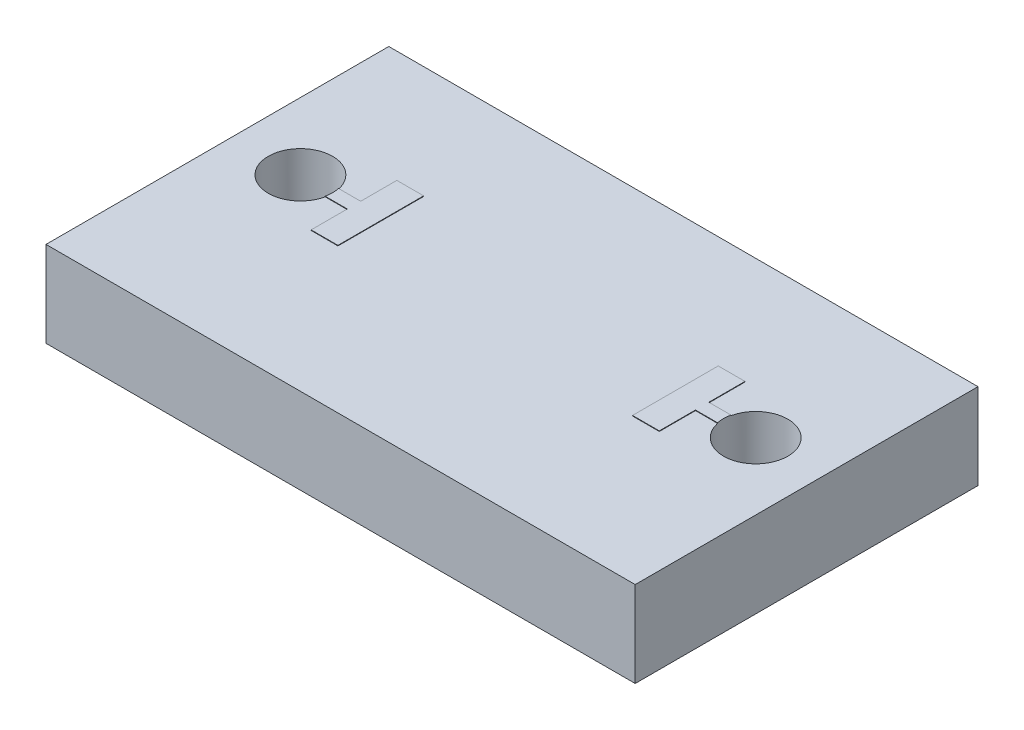
ISO-10303-21;
HEADER;
FILE_DESCRIPTION(('STEP AP214'),'2;1');
FILE_NAME('part.step','',(''),(''),'','','');
FILE_SCHEMA(('AUTOMOTIVE_DESIGN { 1 0 10303 214 1 1 1 1 }'));
ENDSEC;
DATA;
#1=APPLICATION_CONTEXT('core data for automotive mechanical design processes');
#2=APPLICATION_PROTOCOL_DEFINITION('international standard','automotive_design',2000,#1);
#3=PRODUCT_CONTEXT('',#1,'mechanical');
#4=PRODUCT('Part','Part','',(#3));
#5=PRODUCT_RELATED_PRODUCT_CATEGORY('part','',(#4));
#6=PRODUCT_DEFINITION_FORMATION('','',#4);
#7=PRODUCT_DEFINITION_CONTEXT('part definition',#1,'design');
#8=PRODUCT_DEFINITION('design','',#6,#7);
#9=PRODUCT_DEFINITION_SHAPE('','',#8);
#10=(LENGTH_UNIT() NAMED_UNIT(*) SI_UNIT(.MILLI.,.METRE.));
#11=(NAMED_UNIT(*) PLANE_ANGLE_UNIT() SI_UNIT($,.RADIAN.));
#12=(NAMED_UNIT(*) SI_UNIT($,.STERADIAN.) SOLID_ANGLE_UNIT());
#13=UNCERTAINTY_MEASURE_WITH_UNIT(LENGTH_MEASURE(1.E-05),#10,'distance_accuracy_value','');
#14=(GEOMETRIC_REPRESENTATION_CONTEXT(3) GLOBAL_UNCERTAINTY_ASSIGNED_CONTEXT((#13)) GLOBAL_UNIT_ASSIGNED_CONTEXT((#10,
#11,#12)) REPRESENTATION_CONTEXT('',''));
#15=CARTESIAN_POINT('',(0.,0.,0.));
#16=DIRECTION('',(0.,0.,1.));
#17=DIRECTION('',(1.,0.,0.));
#18=AXIS2_PLACEMENT_3D('',#15,#16,#17);
#19=CARTESIAN_POINT('',(0.,1.60000000000001,0.));
#20=DIRECTION('',(0.,-1.,0.));
#21=DIRECTION('',(0.,0.,-1.));
#22=AXIS2_PLACEMENT_3D('',#19,#20,#21);
#23=PLANE('',#22);
#24=DIRECTION('',(-1.,0.,0.));
#25=VECTOR('',#24,1.);
#26=CARTESIAN_POINT('',(0.,1.60000000000001,-0.125000000000004));
#27=LINE('',#26,#25);
#28=CARTESIAN_POINT('',(3.66316527028472,1.60000000000001,-0.125));
#29=VERTEX_POINT('',#28);
#30=CARTESIAN_POINT('',(3.25,1.60000000000001,-0.125000000000004));
#31=VERTEX_POINT('',#30);
#32=EDGE_CURVE('E230',#29,#31,#27,.T.);
#33=ORIENTED_EDGE('',*,*,#32,.F.);
#34=CARTESIAN_POINT('',(4.25,1.60000000000001,0.));
#35=DIRECTION('',(0.,1.,0.));
#36=DIRECTION('',(0.,0.,1.));
#37=AXIS2_PLACEMENT_3D('',#34,#35,#36);
#38=CIRCLE('',#37,0.6);
#39=CARTESIAN_POINT('',(3.66316527028473,1.60000000000001,0.125000000000005));
#40=VERTEX_POINT('',#39);
#41=EDGE_CURVE('E322',#40,#29,#38,.T.);
#42=ORIENTED_EDGE('',*,*,#41,.F.);
#43=DIRECTION('',(-1.,0.,0.));
#44=VECTOR('',#43,1.);
#45=CARTESIAN_POINT('',(0.,1.60000000000001,0.125000000000002));
#46=LINE('',#45,#44);
#47=CARTESIAN_POINT('',(3.25000000000001,1.60000000000001,0.125000000000002));
#48=VERTEX_POINT('',#47);
#49=EDGE_CURVE('E235',#40,#48,#46,.T.);
#50=ORIENTED_EDGE('',*,*,#49,.T.);
#51=DIRECTION('',(0.,0.,-1.));
#52=VECTOR('',#51,1.);
#53=CARTESIAN_POINT('',(3.25,1.60000000000001,0.));
#54=LINE('',#53,#52);
#55=CARTESIAN_POINT('',(3.25,1.60000000000001,0.799999999999999));
#56=VERTEX_POINT('',#55);
#57=EDGE_CURVE('E302',#56,#48,#54,.T.);
#58=ORIENTED_EDGE('',*,*,#57,.F.);
#59=DIRECTION('',(-1.,0.,0.));
#60=VECTOR('',#59,1.);
#61=CARTESIAN_POINT('',(0.,1.60000000000001,0.799999999999995));
#62=LINE('',#61,#60);
#63=CARTESIAN_POINT('',(2.75,1.60000000000001,0.799999999999995));
#64=VERTEX_POINT('',#63);
#65=EDGE_CURVE('E299',#56,#64,#62,.T.);
#66=ORIENTED_EDGE('',*,*,#65,.T.);
#67=DIRECTION('',(0.,0.,-1.));
#68=VECTOR('',#67,1.);
#69=CARTESIAN_POINT('',(2.75,1.60000000000001,0.));
#70=LINE('',#69,#68);
#71=CARTESIAN_POINT('',(2.75,1.60000000000001,-0.800000000000001));
#72=VERTEX_POINT('',#71);
#73=EDGE_CURVE('E283',#64,#72,#70,.T.);
#74=ORIENTED_EDGE('',*,*,#73,.T.);
#75=DIRECTION('',(-1.,0.,0.));
#76=VECTOR('',#75,1.);
#77=CARTESIAN_POINT('',(0.,1.60000000000001,-0.799999999999999));
#78=LINE('',#77,#76);
#79=CARTESIAN_POINT('',(3.25,1.60000000000001,-0.8));
#80=VERTEX_POINT('',#79);
#81=EDGE_CURVE('E288',#80,#72,#78,.T.);
#82=ORIENTED_EDGE('',*,*,#81,.F.);
#83=EDGE_CURVE('E301',#31,#80,#54,.T.);
#84=ORIENTED_EDGE('',*,*,#83,.F.);
#85=EDGE_LOOP('',(#33,#42,#50,#58,#66,#74,#82,#84));
#86=FACE_BOUND('',#85,.T.);
#87=DIRECTION('',(0.,0.,-1.));
#88=VECTOR('',#87,1.);
#89=CARTESIAN_POINT('',(5.5,1.60000000000002,2.));
#90=LINE('',#89,#88);
#91=CARTESIAN_POINT('',(5.5,1.60000000000001,3.50000000000001));
#92=VERTEX_POINT('',#91);
#93=CARTESIAN_POINT('',(5.50000000000001,1.60000000000002,-2.9));
#94=VERTEX_POINT('',#93);
#95=EDGE_CURVE('E47',#92,#94,#90,.T.);
#96=ORIENTED_EDGE('',*,*,#95,.T.);
#97=DIRECTION('',(1.,0.,0.));
#98=VECTOR('',#97,1.);
#99=CARTESIAN_POINT('',(-5.5,1.60000000000001,-2.9));
#100=LINE('',#99,#98);
#101=CARTESIAN_POINT('',(-5.5,1.60000000000001,-2.9));
#102=VERTEX_POINT('',#101);
#103=EDGE_CURVE('E185',#102,#94,#100,.T.);
#104=ORIENTED_EDGE('',*,*,#103,.F.);
#105=DIRECTION('',(0.,0.,1.));
#106=VECTOR('',#105,1.);
#107=CARTESIAN_POINT('',(-5.5,1.60000000000001,2.));
#108=LINE('',#107,#106);
#109=CARTESIAN_POINT('',(-5.5,1.60000000000001,3.50000000000001));
#110=VERTEX_POINT('',#109);
#111=EDGE_CURVE('E11',#102,#110,#108,.T.);
#112=ORIENTED_EDGE('',*,*,#111,.T.);
#113=DIRECTION('',(-1.,0.,0.));
#114=VECTOR('',#113,1.);
#115=CARTESIAN_POINT('',(-5.5,1.60000000000001,3.50000000000001));
#116=LINE('',#115,#114);
#117=EDGE_CURVE('E206',#92,#110,#116,.T.);
#118=ORIENTED_EDGE('',*,*,#117,.F.);
#119=EDGE_LOOP('',(#96,#104,#112,#118));
#120=FACE_BOUND('',#119,.T.);
#121=DIRECTION('',(1.,0.,0.));
#122=VECTOR('',#121,1.);
#123=CARTESIAN_POINT('',(0.,1.60000000000001,0.125000000000002));
#124=LINE('',#123,#122);
#125=CARTESIAN_POINT('',(-3.66316527028473,1.60000000000001,0.125000000000007));
#126=VERTEX_POINT('',#125);
#127=CARTESIAN_POINT('',(-3.25,1.60000000000001,0.125000000000009));
#128=VERTEX_POINT('',#127);
#129=EDGE_CURVE('E55',#126,#128,#124,.T.);
#130=ORIENTED_EDGE('',*,*,#129,.F.);
#131=CARTESIAN_POINT('',(-4.25,1.60000000000001,0.));
#132=DIRECTION('',(0.,1.,0.));
#133=DIRECTION('',(0.,0.,1.));
#134=AXIS2_PLACEMENT_3D('',#131,#132,#133);
#135=CIRCLE('',#134,0.6);
#136=CARTESIAN_POINT('',(-3.66316527028472,1.60000000000001,-0.125000000000004));
#137=VERTEX_POINT('',#136);
#138=EDGE_CURVE('E59',#126,#137,#135,.F.);
#139=ORIENTED_EDGE('',*,*,#138,.T.);
#140=DIRECTION('',(1.,0.,0.));
#141=VECTOR('',#140,1.);
#142=CARTESIAN_POINT('',(0.,1.60000000000001,-0.125000000000004));
#143=LINE('',#142,#141);
#144=CARTESIAN_POINT('',(-3.25,1.60000000000001,-0.125000000000002));
#145=VERTEX_POINT('',#144);
#146=EDGE_CURVE('E212',#137,#145,#143,.T.);
#147=ORIENTED_EDGE('',*,*,#146,.T.);
#148=DIRECTION('',(0.,0.,-1.));
#149=VECTOR('',#148,1.);
#150=CARTESIAN_POINT('',(-3.25,1.60000000000001,0.));
#151=LINE('',#150,#149);
#152=CARTESIAN_POINT('',(-3.25,1.60000000000001,-0.800000000000004));
#153=VERTEX_POINT('',#152);
#154=EDGE_CURVE('E252',#145,#153,#151,.T.);
#155=ORIENTED_EDGE('',*,*,#154,.T.);
#156=DIRECTION('',(1.,0.,0.));
#157=VECTOR('',#156,1.);
#158=CARTESIAN_POINT('',(0.,1.60000000000001,-0.799999999999999));
#159=LINE('',#158,#157);
#160=CARTESIAN_POINT('',(-2.75,1.60000000000001,-0.799999999999999));
#161=VERTEX_POINT('',#160);
#162=EDGE_CURVE('E270',#153,#161,#159,.T.);
#163=ORIENTED_EDGE('',*,*,#162,.T.);
#164=DIRECTION('',(0.,0.,-1.));
#165=VECTOR('',#164,1.);
#166=CARTESIAN_POINT('',(-2.75,1.60000000000001,0.));
#167=LINE('',#166,#165);
#168=CARTESIAN_POINT('',(-2.75,1.60000000000001,0.799999999999995));
#169=VERTEX_POINT('',#168);
#170=EDGE_CURVE('E268',#169,#161,#167,.T.);
#171=ORIENTED_EDGE('',*,*,#170,.F.);
#172=DIRECTION('',(1.,0.,0.));
#173=VECTOR('',#172,1.);
#174=CARTESIAN_POINT('',(0.,1.60000000000001,0.799999999999995));
#175=LINE('',#174,#173);
#176=CARTESIAN_POINT('',(-3.25,1.60000000000001,0.799999999999995));
#177=VERTEX_POINT('',#176);
#178=EDGE_CURVE('E266',#177,#169,#175,.T.);
#179=ORIENTED_EDGE('',*,*,#178,.F.);
#180=EDGE_CURVE('E264',#177,#128,#151,.T.);
#181=ORIENTED_EDGE('',*,*,#180,.T.);
#182=EDGE_LOOP('',(#130,#139,#147,#155,#163,#171,#179,#181));
#183=FACE_BOUND('',#182,.T.);
#184=ADVANCED_FACE('F38',(#86,#120,#183),#23,.F.);
#185=CARTESIAN_POINT('',(-3.25,1.61000000000001,0.));
#186=DIRECTION('',(-1.,0.,0.));
#187=DIRECTION('',(0.,0.,1.));
#188=AXIS2_PLACEMENT_3D('',#185,#186,#187);
#189=PLANE('',#188);
#190=DIRECTION('',(0.,0.,-1.));
#191=VECTOR('',#190,1.);
#192=CARTESIAN_POINT('',(-3.25,1.61000000000001,0.));
#193=LINE('',#192,#191);
#194=CARTESIAN_POINT('',(-3.25,1.61000000000001,0.799999999999995));
#195=VERTEX_POINT('',#194);
#196=CARTESIAN_POINT('',(-3.25,1.61,0.125000000000005));
#197=VERTEX_POINT('',#196);
#198=EDGE_CURVE('E253',#195,#197,#193,.T.);
#199=ORIENTED_EDGE('',*,*,#198,.T.);
#200=DIRECTION('',(0.,-1.,0.));
#201=VECTOR('',#200,1.);
#202=CARTESIAN_POINT('',(-3.25,1.61,0.125000000000005));
#203=LINE('',#202,#201);
#204=EDGE_CURVE('E225',#197,#128,#203,.T.);
#205=ORIENTED_EDGE('',*,*,#204,.T.);
#206=ORIENTED_EDGE('',*,*,#180,.F.);
#207=DIRECTION('',(0.,-1.,0.));
#208=VECTOR('',#207,1.);
#209=CARTESIAN_POINT('',(-3.25,1.61000000000001,0.799999999999995));
#210=LINE('',#209,#208);
#211=EDGE_CURVE('E281',#195,#177,#210,.T.);
#212=ORIENTED_EDGE('',*,*,#211,.F.);
#213=EDGE_LOOP('',(#199,#205,#206,#212));
#214=FACE_BOUND('',#213,.T.);
#215=ADVANCED_FACE('F347',(#214),#189,.T.);
#216=CARTESIAN_POINT('',(3.25,1.61000000000001,0.));
#217=DIRECTION('',(-1.,0.,0.));
#218=DIRECTION('',(0.,0.,1.));
#219=AXIS2_PLACEMENT_3D('',#216,#217,#218);
#220=PLANE('',#219);
#221=DIRECTION('',(0.,-1.,0.));
#222=VECTOR('',#221,1.);
#223=CARTESIAN_POINT('',(3.25,1.61000000000001,-0.125000000000004));
#224=LINE('',#223,#222);
#225=CARTESIAN_POINT('',(3.25,1.61000000000001,-0.125000000000004));
#226=VERTEX_POINT('',#225);
#227=EDGE_CURVE('E247',#226,#31,#224,.T.);
#228=ORIENTED_EDGE('',*,*,#227,.T.);
#229=ORIENTED_EDGE('',*,*,#83,.T.);
#230=DIRECTION('',(0.,-1.,0.));
#231=VECTOR('',#230,1.);
#232=CARTESIAN_POINT('',(3.25,1.61000000000001,-0.799999999999999));
#233=LINE('',#232,#231);
#234=CARTESIAN_POINT('',(3.25,1.61000000000001,-0.799999999999999));
#235=VERTEX_POINT('',#234);
#236=EDGE_CURVE('E309',#235,#80,#233,.T.);
#237=ORIENTED_EDGE('',*,*,#236,.F.);
#238=DIRECTION('',(0.,0.,-1.));
#239=VECTOR('',#238,1.);
#240=CARTESIAN_POINT('',(3.25,1.61000000000001,0.));
#241=LINE('',#240,#239);
#242=EDGE_CURVE('E291',#226,#235,#241,.T.);
#243=ORIENTED_EDGE('',*,*,#242,.F.);
#244=EDGE_LOOP('',(#228,#229,#237,#243));
#245=FACE_BOUND('',#244,.T.);
#246=ADVANCED_FACE('F343',(#245),#220,.F.);
#247=CARTESIAN_POINT('',(0.,0.,0.));
#248=DIRECTION('',(0.,-1.,0.));
#249=DIRECTION('',(0.,0.,-1.));
#250=AXIS2_PLACEMENT_3D('',#247,#248,#249);
#251=PLANE('',#250);
#252=CARTESIAN_POINT('',(-4.25,0.,0.));
#253=DIRECTION('',(0.,1.,0.));
#254=DIRECTION('',(0.,0.,1.));
#255=AXIS2_PLACEMENT_3D('',#252,#253,#254);
#256=CIRCLE('',#255,0.6);
#257=CARTESIAN_POINT('',(-4.25,0.,0.6));
#258=VERTEX_POINT('',#257);
#259=EDGE_CURVE('E325',#258,#258,#256,.F.);
#260=ORIENTED_EDGE('',*,*,#259,.F.);
#261=EDGE_LOOP('',(#260));
#262=FACE_BOUND('',#261,.T.);
#263=DIRECTION('',(0.,0.,-1.));
#264=VECTOR('',#263,1.);
#265=CARTESIAN_POINT('',(5.5,0.,2.));
#266=LINE('',#265,#264);
#267=CARTESIAN_POINT('',(5.5,0.,3.50000000000002));
#268=VERTEX_POINT('',#267);
#269=CARTESIAN_POINT('',(5.5,0.,-2.9));
#270=VERTEX_POINT('',#269);
#271=EDGE_CURVE('E321',#268,#270,#266,.T.);
#272=ORIENTED_EDGE('',*,*,#271,.F.);
#273=DIRECTION('',(1.,0.,0.));
#274=VECTOR('',#273,1.);
#275=CARTESIAN_POINT('',(-5.5,0.,3.50000000000001));
#276=LINE('',#275,#274);
#277=CARTESIAN_POINT('',(-5.5,0.,3.50000000000001));
#278=VERTEX_POINT('',#277);
#279=EDGE_CURVE('E200',#278,#268,#276,.T.);
#280=ORIENTED_EDGE('',*,*,#279,.F.);
#281=DIRECTION('',(0.,0.,1.));
#282=VECTOR('',#281,1.);
#283=CARTESIAN_POINT('',(-5.5,0.,2.));
#284=LINE('',#283,#282);
#285=CARTESIAN_POINT('',(-5.5,0.,-2.90000000000001));
#286=VERTEX_POINT('',#285);
#287=EDGE_CURVE('E42',#286,#278,#284,.T.);
#288=ORIENTED_EDGE('',*,*,#287,.F.);
#289=DIRECTION('',(-1.,0.,0.));
#290=VECTOR('',#289,1.);
#291=CARTESIAN_POINT('',(-5.5,0.,-2.90000000000001));
#292=LINE('',#291,#290);
#293=EDGE_CURVE('E194',#270,#286,#292,.T.);
#294=ORIENTED_EDGE('',*,*,#293,.F.);
#295=EDGE_LOOP('',(#272,#280,#288,#294));
#296=FACE_BOUND('',#295,.T.);
#297=CARTESIAN_POINT('',(4.25,0.,0.));
#298=DIRECTION('',(0.,1.,0.));
#299=DIRECTION('',(0.,0.,1.));
#300=AXIS2_PLACEMENT_3D('',#297,#298,#299);
#301=CIRCLE('',#300,0.6);
#302=CARTESIAN_POINT('',(4.25,0.,0.599999999999997));
#303=VERTEX_POINT('',#302);
#304=EDGE_CURVE('E318',#303,#303,#301,.T.);
#305=ORIENTED_EDGE('',*,*,#304,.T.);
#306=EDGE_LOOP('',(#305));
#307=FACE_BOUND('',#306,.T.);
#308=ADVANCED_FACE('F333',(#262,#296,#307),#251,.T.);
#309=CARTESIAN_POINT('',(5.5,1.60000000000002,2.));
#310=DIRECTION('',(-1.,0.,0.));
#311=DIRECTION('',(0.,0.,1.));
#312=AXIS2_PLACEMENT_3D('',#309,#310,#311);
#313=PLANE('',#312);
#314=ORIENTED_EDGE('',*,*,#271,.T.);
#315=DIRECTION('',(0.,-1.,0.));
#316=VECTOR('',#315,1.);
#317=CARTESIAN_POINT('',(5.50000000000001,1.60000000000002,-2.9));
#318=LINE('',#317,#316);
#319=EDGE_CURVE('E189',#94,#270,#318,.T.);
#320=ORIENTED_EDGE('',*,*,#319,.F.);
#321=ORIENTED_EDGE('',*,*,#95,.F.);
#322=DIRECTION('',(0.,1.,0.));
#323=VECTOR('',#322,1.);
#324=CARTESIAN_POINT('',(5.5,1.60000000000001,3.50000000000001));
#325=LINE('',#324,#323);
#326=EDGE_CURVE('E203',#268,#92,#325,.T.);
#327=ORIENTED_EDGE('',*,*,#326,.F.);
#328=EDGE_LOOP('',(#314,#320,#321,#327));
#329=FACE_BOUND('',#328,.T.);
#330=ADVANCED_FACE('F40',(#329),#313,.F.);
#331=CARTESIAN_POINT('',(-5.5,1.60000000000001,2.));
#332=DIRECTION('',(1.,0.,0.));
#333=DIRECTION('',(0.,0.,-1.));
#334=AXIS2_PLACEMENT_3D('',#331,#332,#333);
#335=PLANE('',#334);
#336=ORIENTED_EDGE('',*,*,#287,.T.);
#337=DIRECTION('',(0.,-1.,0.));
#338=VECTOR('',#337,1.);
#339=CARTESIAN_POINT('',(-5.5,1.60000000000001,3.50000000000001));
#340=LINE('',#339,#338);
#341=EDGE_CURVE('E180',#110,#278,#340,.T.);
#342=ORIENTED_EDGE('',*,*,#341,.F.);
#343=ORIENTED_EDGE('',*,*,#111,.F.);
#344=DIRECTION('',(0.,1.,0.));
#345=VECTOR('',#344,1.);
#346=CARTESIAN_POINT('',(-5.5,1.60000000000001,-2.9));
#347=LINE('',#346,#345);
#348=EDGE_CURVE('E178',#286,#102,#347,.T.);
#349=ORIENTED_EDGE('',*,*,#348,.F.);
#350=EDGE_LOOP('',(#336,#342,#343,#349));
#351=FACE_BOUND('',#350,.T.);
#352=ADVANCED_FACE('F176',(#351),#335,.F.);
#353=CARTESIAN_POINT('',(-4.25,0.,0.));
#354=DIRECTION('',(0.,1.,0.));
#355=DIRECTION('',(0.,0.,1.));
#356=AXIS2_PLACEMENT_3D('',#353,#354,#355);
#357=CYLINDRICAL_SURFACE('',#356,0.6);
#358=ORIENTED_EDGE('',*,*,#259,.T.);
#359=EDGE_LOOP('',(#358));
#360=FACE_BOUND('',#359,.T.);
#361=ORIENTED_EDGE('',*,*,#138,.F.);
#362=DIRECTION('',(0.,-1.,0.));
#363=VECTOR('',#362,1.);
#364=CARTESIAN_POINT('',(-3.66316527028473,1.61,0.125000000000007));
#365=LINE('',#364,#363);
#366=CARTESIAN_POINT('',(-3.66316527028473,1.61,0.125000000000007));
#367=VERTEX_POINT('',#366);
#368=EDGE_CURVE('E227',#367,#126,#365,.T.);
#369=ORIENTED_EDGE('',*,*,#368,.F.);
#370=CARTESIAN_POINT('',(-4.25,1.61000000000001,0.));
#371=DIRECTION('',(0.,1.,0.));
#372=DIRECTION('',(0.,0.,1.));
#373=AXIS2_PLACEMENT_3D('',#370,#371,#372);
#374=CIRCLE('',#373,0.6);
#375=CARTESIAN_POINT('',(-3.66316527028472,1.61000000000002,-0.125000000000004));
#376=VERTEX_POINT('',#375);
#377=EDGE_CURVE('E208',#376,#367,#374,.F.);
#378=ORIENTED_EDGE('',*,*,#377,.F.);
#379=DIRECTION('',(0.,-1.,0.));
#380=VECTOR('',#379,1.);
#381=CARTESIAN_POINT('',(-3.66316527028472,1.61000000000002,-0.125000000000004));
#382=LINE('',#381,#380);
#383=EDGE_CURVE('E218',#376,#137,#382,.T.);
#384=ORIENTED_EDGE('',*,*,#383,.T.);
#385=EDGE_LOOP('',(#361,#369,#378,#384));
#386=FACE_BOUND('',#385,.T.);
#387=ADVANCED_FACE('F342',(#360,#386),#357,.F.);
#388=CARTESIAN_POINT('',(4.25,0.,0.));
#389=DIRECTION('',(0.,1.,0.));
#390=DIRECTION('',(0.,0.,1.));
#391=AXIS2_PLACEMENT_3D('',#388,#389,#390);
#392=CYLINDRICAL_SURFACE('',#391,0.6);
#393=ORIENTED_EDGE('',*,*,#304,.F.);
#394=EDGE_LOOP('',(#393));
#395=FACE_BOUND('',#394,.T.);
#396=ORIENTED_EDGE('',*,*,#41,.T.);
#397=DIRECTION('',(0.,-1.,0.));
#398=VECTOR('',#397,1.);
#399=CARTESIAN_POINT('',(3.66316527028472,1.61000000000001,-0.125000000000004));
#400=LINE('',#399,#398);
#401=CARTESIAN_POINT('',(3.66316527028472,1.61000000000001,-0.125000000000004));
#402=VERTEX_POINT('',#401);
#403=EDGE_CURVE('E250',#402,#29,#400,.T.);
#404=ORIENTED_EDGE('',*,*,#403,.F.);
#405=CARTESIAN_POINT('',(4.25,1.61000000000002,0.));
#406=DIRECTION('',(0.,1.,0.));
#407=DIRECTION('',(0.,0.,1.));
#408=AXIS2_PLACEMENT_3D('',#405,#406,#407);
#409=CIRCLE('',#408,0.6);
#410=CARTESIAN_POINT('',(3.66316527028472,1.61,0.125000000000002));
#411=VERTEX_POINT('',#410);
#412=EDGE_CURVE('E231',#411,#402,#409,.F.);
#413=ORIENTED_EDGE('',*,*,#412,.F.);
#414=DIRECTION('',(0.,-1.,0.));
#415=VECTOR('',#414,1.);
#416=CARTESIAN_POINT('',(3.66316527028472,1.61,0.125000000000002));
#417=LINE('',#416,#415);
#418=EDGE_CURVE('E240',#411,#40,#417,.T.);
#419=ORIENTED_EDGE('',*,*,#418,.T.);
#420=EDGE_LOOP('',(#396,#404,#413,#419));
#421=FACE_BOUND('',#420,.T.);
#422=ADVANCED_FACE('F360',(#395,#421),#392,.F.);
#423=CARTESIAN_POINT('',(2.75,1.61000000000001,0.));
#424=DIRECTION('',(-1.,0.,0.));
#425=DIRECTION('',(0.,0.,1.));
#426=AXIS2_PLACEMENT_3D('',#423,#424,#425);
#427=PLANE('',#426);
#428=ORIENTED_EDGE('',*,*,#73,.F.);
#429=DIRECTION('',(0.,-1.,0.));
#430=VECTOR('',#429,1.);
#431=CARTESIAN_POINT('',(2.75,1.61000000000001,0.799999999999999));
#432=LINE('',#431,#430);
#433=CARTESIAN_POINT('',(2.75,1.61000000000001,0.799999999999999));
#434=VERTEX_POINT('',#433);
#435=EDGE_CURVE('E315',#434,#64,#432,.T.);
#436=ORIENTED_EDGE('',*,*,#435,.F.);
#437=DIRECTION('',(0.,0.,-1.));
#438=VECTOR('',#437,1.);
#439=CARTESIAN_POINT('',(2.75,1.61000000000001,0.));
#440=LINE('',#439,#438);
#441=CARTESIAN_POINT('',(2.75,1.61000000000001,-0.799999999999999));
#442=VERTEX_POINT('',#441);
#443=EDGE_CURVE('E284',#434,#442,#440,.T.);
#444=ORIENTED_EDGE('',*,*,#443,.T.);
#445=DIRECTION('',(0.,-1.,0.));
#446=VECTOR('',#445,1.);
#447=CARTESIAN_POINT('',(2.75,1.61000000000001,-0.799999999999999));
#448=LINE('',#447,#446);
#449=EDGE_CURVE('E297',#442,#72,#448,.T.);
#450=ORIENTED_EDGE('',*,*,#449,.T.);
#451=EDGE_LOOP('',(#428,#436,#444,#450));
#452=FACE_BOUND('',#451,.T.);
#453=ADVANCED_FACE('F364',(#452),#427,.T.);
#454=CARTESIAN_POINT('',(0.,1.61000000000001,0.8));
#455=DIRECTION('',(0.,0.,1.));
#456=DIRECTION('',(1.,0.,0.));
#457=AXIS2_PLACEMENT_3D('',#454,#455,#456);
#458=PLANE('',#457);
#459=ORIENTED_EDGE('',*,*,#65,.F.);
#460=DIRECTION('',(0.,-1.,0.));
#461=VECTOR('',#460,1.);
#462=CARTESIAN_POINT('',(3.25,1.61000000000001,0.799999999999993));
#463=LINE('',#462,#461);
#464=CARTESIAN_POINT('',(3.25,1.61000000000001,0.799999999999993));
#465=VERTEX_POINT('',#464);
#466=EDGE_CURVE('E312',#465,#56,#463,.T.);
#467=ORIENTED_EDGE('',*,*,#466,.F.);
#468=DIRECTION('',(-1.,0.,0.));
#469=VECTOR('',#468,1.);
#470=CARTESIAN_POINT('',(0.,1.61000000000001,0.8));
#471=LINE('',#470,#469);
#472=EDGE_CURVE('E287',#465,#434,#471,.T.);
#473=ORIENTED_EDGE('',*,*,#472,.T.);
#474=ORIENTED_EDGE('',*,*,#435,.T.);
#475=EDGE_LOOP('',(#459,#467,#473,#474));
#476=FACE_BOUND('',#475,.T.);
#477=ADVANCED_FACE('F368',(#476),#458,.T.);
#478=ORIENTED_EDGE('',*,*,#57,.T.);
#479=DIRECTION('',(0.,-1.,0.));
#480=VECTOR('',#479,1.);
#481=CARTESIAN_POINT('',(3.25,1.61,0.125000000000004));
#482=LINE('',#481,#480);
#483=CARTESIAN_POINT('',(3.25,1.61,0.125000000000004));
#484=VERTEX_POINT('',#483);
#485=EDGE_CURVE('E245',#484,#48,#482,.T.);
#486=ORIENTED_EDGE('',*,*,#485,.F.);
#487=EDGE_CURVE('E292',#465,#484,#241,.T.);
#488=ORIENTED_EDGE('',*,*,#487,.F.);
#489=ORIENTED_EDGE('',*,*,#466,.T.);
#490=EDGE_LOOP('',(#478,#486,#488,#489));
#491=FACE_BOUND('',#490,.T.);
#492=ADVANCED_FACE('F372',(#491),#220,.F.);
#493=CARTESIAN_POINT('',(0.,1.61000000000001,-0.8));
#494=DIRECTION('',(0.,0.,1.));
#495=DIRECTION('',(1.,0.,0.));
#496=AXIS2_PLACEMENT_3D('',#493,#494,#495);
#497=PLANE('',#496);
#498=ORIENTED_EDGE('',*,*,#81,.T.);
#499=ORIENTED_EDGE('',*,*,#449,.F.);
#500=DIRECTION('',(-1.,0.,0.));
#501=VECTOR('',#500,1.);
#502=CARTESIAN_POINT('',(0.,1.61000000000001,-0.8));
#503=LINE('',#502,#501);
#504=EDGE_CURVE('E295',#235,#442,#503,.T.);
#505=ORIENTED_EDGE('',*,*,#504,.F.);
#506=ORIENTED_EDGE('',*,*,#236,.T.);
#507=EDGE_LOOP('',(#498,#499,#505,#506));
#508=FACE_BOUND('',#507,.T.);
#509=ADVANCED_FACE('F376',(#508),#497,.F.);
#510=CARTESIAN_POINT('',(0.,1.61,0.));
#511=DIRECTION('',(0.,1.,0.));
#512=DIRECTION('',(0.,0.,1.));
#513=AXIS2_PLACEMENT_3D('',#510,#511,#512);
#514=PLANE('',#513);
#515=ORIENTED_EDGE('',*,*,#443,.F.);
#516=ORIENTED_EDGE('',*,*,#472,.F.);
#517=ORIENTED_EDGE('',*,*,#487,.T.);
#518=DIRECTION('',(-1.,0.,0.));
#519=VECTOR('',#518,1.);
#520=CARTESIAN_POINT('',(0.,1.61,0.125000000000004));
#521=LINE('',#520,#519);
#522=EDGE_CURVE('E238',#411,#484,#521,.T.);
#523=ORIENTED_EDGE('',*,*,#522,.F.);
#524=ORIENTED_EDGE('',*,*,#412,.T.);
#525=DIRECTION('',(-1.,0.,0.));
#526=VECTOR('',#525,1.);
#527=CARTESIAN_POINT('',(0.,1.61000000000001,-0.125000000000004));
#528=LINE('',#527,#526);
#529=EDGE_CURVE('E234',#402,#226,#528,.T.);
#530=ORIENTED_EDGE('',*,*,#529,.T.);
#531=ORIENTED_EDGE('',*,*,#242,.T.);
#532=ORIENTED_EDGE('',*,*,#504,.T.);
#533=EDGE_LOOP('',(#515,#516,#517,#523,#524,#530,#531,#532));
#534=FACE_BOUND('',#533,.T.);
#535=ADVANCED_FACE('F380',(#534),#514,.T.);
#536=DIRECTION('',(0.,-1.,0.));
#537=VECTOR('',#536,1.);
#538=CARTESIAN_POINT('',(-3.25,1.61000000000001,-0.125000000000002));
#539=LINE('',#538,#537);
#540=CARTESIAN_POINT('',(-3.25,1.61000000000001,-0.125000000000002));
#541=VERTEX_POINT('',#540);
#542=EDGE_CURVE('E222',#541,#145,#539,.T.);
#543=ORIENTED_EDGE('',*,*,#542,.F.);
#544=CARTESIAN_POINT('',(-3.25,1.61000000000001,-0.799999999999999));
#545=VERTEX_POINT('',#544);
#546=EDGE_CURVE('E256',#541,#545,#193,.T.);
#547=ORIENTED_EDGE('',*,*,#546,.T.);
#548=DIRECTION('',(0.,-1.,0.));
#549=VECTOR('',#548,1.);
#550=CARTESIAN_POINT('',(-3.25,1.61000000000001,-0.799999999999999));
#551=LINE('',#550,#549);
#552=EDGE_CURVE('E263',#545,#153,#551,.T.);
#553=ORIENTED_EDGE('',*,*,#552,.T.);
#554=ORIENTED_EDGE('',*,*,#154,.F.);
#555=EDGE_LOOP('',(#543,#547,#553,#554));
#556=FACE_BOUND('',#555,.T.);
#557=ADVANCED_FACE('F355',(#556),#189,.T.);
#558=CARTESIAN_POINT('',(0.,1.61000000000001,0.8));
#559=DIRECTION('',(0.,0.,-1.));
#560=DIRECTION('',(-1.,0.,0.));
#561=AXIS2_PLACEMENT_3D('',#558,#559,#560);
#562=PLANE('',#561);
#563=ORIENTED_EDGE('',*,*,#178,.T.);
#564=DIRECTION('',(0.,-1.,0.));
#565=VECTOR('',#564,1.);
#566=CARTESIAN_POINT('',(-2.75,1.61000000000001,0.799999999999997));
#567=LINE('',#566,#565);
#568=CARTESIAN_POINT('',(-2.75,1.61000000000001,0.799999999999997));
#569=VERTEX_POINT('',#568);
#570=EDGE_CURVE('E278',#569,#169,#567,.T.);
#571=ORIENTED_EDGE('',*,*,#570,.F.);
#572=DIRECTION('',(1.,0.,0.));
#573=VECTOR('',#572,1.);
#574=CARTESIAN_POINT('',(0.,1.61000000000001,0.8));
#575=LINE('',#574,#573);
#576=EDGE_CURVE('E255',#195,#569,#575,.T.);
#577=ORIENTED_EDGE('',*,*,#576,.F.);
#578=ORIENTED_EDGE('',*,*,#211,.T.);
#579=EDGE_LOOP('',(#563,#571,#577,#578));
#580=FACE_BOUND('',#579,.T.);
#581=ADVANCED_FACE('F386',(#580),#562,.F.);
#582=CARTESIAN_POINT('',(-2.75,1.61000000000002,0.));
#583=DIRECTION('',(-1.,0.,0.));
#584=DIRECTION('',(0.,0.,1.));
#585=AXIS2_PLACEMENT_3D('',#582,#583,#584);
#586=PLANE('',#585);
#587=ORIENTED_EDGE('',*,*,#170,.T.);
#588=DIRECTION('',(0.,-1.,0.));
#589=VECTOR('',#588,1.);
#590=CARTESIAN_POINT('',(-2.75,1.61000000000002,-0.8));
#591=LINE('',#590,#589);
#592=CARTESIAN_POINT('',(-2.75,1.61000000000002,-0.8));
#593=VERTEX_POINT('',#592);
#594=EDGE_CURVE('E275',#593,#161,#591,.T.);
#595=ORIENTED_EDGE('',*,*,#594,.F.);
#596=DIRECTION('',(0.,0.,-1.));
#597=VECTOR('',#596,1.);
#598=CARTESIAN_POINT('',(-2.75,1.61000000000002,0.));
#599=LINE('',#598,#597);
#600=EDGE_CURVE('E258',#569,#593,#599,.T.);
#601=ORIENTED_EDGE('',*,*,#600,.F.);
#602=ORIENTED_EDGE('',*,*,#570,.T.);
#603=EDGE_LOOP('',(#587,#595,#601,#602));
#604=FACE_BOUND('',#603,.T.);
#605=ADVANCED_FACE('F390',(#604),#586,.F.);
#606=CARTESIAN_POINT('',(0.,1.61000000000001,-0.8));
#607=DIRECTION('',(0.,0.,-1.));
#608=DIRECTION('',(-1.,0.,0.));
#609=AXIS2_PLACEMENT_3D('',#606,#607,#608);
#610=PLANE('',#609);
#611=ORIENTED_EDGE('',*,*,#162,.F.);
#612=ORIENTED_EDGE('',*,*,#552,.F.);
#613=DIRECTION('',(1.,0.,0.));
#614=VECTOR('',#613,1.);
#615=CARTESIAN_POINT('',(0.,1.61000000000001,-0.8));
#616=LINE('',#615,#614);
#617=EDGE_CURVE('E260',#545,#593,#616,.T.);
#618=ORIENTED_EDGE('',*,*,#617,.T.);
#619=ORIENTED_EDGE('',*,*,#594,.T.);
#620=EDGE_LOOP('',(#611,#612,#618,#619));
#621=FACE_BOUND('',#620,.T.);
#622=ADVANCED_FACE('F394',(#621),#610,.T.);
#623=CARTESIAN_POINT('',(0.,1.61,0.));
#624=DIRECTION('',(0.,1.,0.));
#625=DIRECTION('',(0.,0.,1.));
#626=AXIS2_PLACEMENT_3D('',#623,#624,#625);
#627=PLANE('',#626);
#628=ORIENTED_EDGE('',*,*,#198,.F.);
#629=ORIENTED_EDGE('',*,*,#576,.T.);
#630=ORIENTED_EDGE('',*,*,#600,.T.);
#631=ORIENTED_EDGE('',*,*,#617,.F.);
#632=ORIENTED_EDGE('',*,*,#546,.F.);
#633=DIRECTION('',(1.,0.,0.));
#634=VECTOR('',#633,1.);
#635=CARTESIAN_POINT('',(0.,1.61000000000001,-0.125000000000004));
#636=LINE('',#635,#634);
#637=EDGE_CURVE('E215',#376,#541,#636,.T.);
#638=ORIENTED_EDGE('',*,*,#637,.F.);
#639=ORIENTED_EDGE('',*,*,#377,.T.);
#640=DIRECTION('',(1.,0.,0.));
#641=VECTOR('',#640,1.);
#642=CARTESIAN_POINT('',(0.,1.61,0.125000000000004));
#643=LINE('',#642,#641);
#644=EDGE_CURVE('E211',#367,#197,#643,.T.);
#645=ORIENTED_EDGE('',*,*,#644,.T.);
#646=EDGE_LOOP('',(#628,#629,#630,#631,#632,#638,#639,#645));
#647=FACE_BOUND('',#646,.T.);
#648=ADVANCED_FACE('F398',(#647),#627,.T.);
#649=CARTESIAN_POINT('',(0.,1.61000000000001,-0.125000000000004));
#650=DIRECTION('',(0.,0.,1.));
#651=DIRECTION('',(1.,0.,0.));
#652=AXIS2_PLACEMENT_3D('',#649,#650,#651);
#653=PLANE('',#652);
#654=ORIENTED_EDGE('',*,*,#32,.T.);
#655=ORIENTED_EDGE('',*,*,#227,.F.);
#656=ORIENTED_EDGE('',*,*,#529,.F.);
#657=ORIENTED_EDGE('',*,*,#403,.T.);
#658=EDGE_LOOP('',(#654,#655,#656,#657));
#659=FACE_BOUND('',#658,.T.);
#660=ADVANCED_FACE('F402',(#659),#653,.F.);
#661=CARTESIAN_POINT('',(0.,1.61,0.125000000000004));
#662=DIRECTION('',(0.,0.,1.));
#663=DIRECTION('',(1.,0.,0.));
#664=AXIS2_PLACEMENT_3D('',#661,#662,#663);
#665=PLANE('',#664);
#666=ORIENTED_EDGE('',*,*,#49,.F.);
#667=ORIENTED_EDGE('',*,*,#418,.F.);
#668=ORIENTED_EDGE('',*,*,#522,.T.);
#669=ORIENTED_EDGE('',*,*,#485,.T.);
#670=EDGE_LOOP('',(#666,#667,#668,#669));
#671=FACE_BOUND('',#670,.T.);
#672=ADVANCED_FACE('F406',(#671),#665,.T.);
#673=CARTESIAN_POINT('',(0.,1.61,0.125000000000004));
#674=DIRECTION('',(0.,0.,-1.));
#675=DIRECTION('',(-1.,0.,0.));
#676=AXIS2_PLACEMENT_3D('',#673,#674,#675);
#677=PLANE('',#676);
#678=ORIENTED_EDGE('',*,*,#129,.T.);
#679=ORIENTED_EDGE('',*,*,#204,.F.);
#680=ORIENTED_EDGE('',*,*,#644,.F.);
#681=ORIENTED_EDGE('',*,*,#368,.T.);
#682=EDGE_LOOP('',(#678,#679,#680,#681));
#683=FACE_BOUND('',#682,.T.);
#684=ADVANCED_FACE('F410',(#683),#677,.F.);
#685=CARTESIAN_POINT('',(0.,1.61000000000001,-0.125000000000004));
#686=DIRECTION('',(0.,0.,-1.));
#687=DIRECTION('',(-1.,0.,0.));
#688=AXIS2_PLACEMENT_3D('',#685,#686,#687);
#689=PLANE('',#688);
#690=ORIENTED_EDGE('',*,*,#146,.F.);
#691=ORIENTED_EDGE('',*,*,#383,.F.);
#692=ORIENTED_EDGE('',*,*,#637,.T.);
#693=ORIENTED_EDGE('',*,*,#542,.T.);
#694=EDGE_LOOP('',(#690,#691,#692,#693));
#695=FACE_BOUND('',#694,.T.);
#696=ADVANCED_FACE('F414',(#695),#689,.T.);
#697=CARTESIAN_POINT('',(0.,0.,3.50000000000001));
#698=DIRECTION('',(0.,0.,1.));
#699=DIRECTION('',(1.,0.,0.));
#700=AXIS2_PLACEMENT_3D('',#697,#698,#699);
#701=PLANE('',#700);
#702=ORIENTED_EDGE('',*,*,#341,.T.);
#703=ORIENTED_EDGE('',*,*,#279,.T.);
#704=ORIENTED_EDGE('',*,*,#326,.T.);
#705=ORIENTED_EDGE('',*,*,#117,.T.);
#706=EDGE_LOOP('',(#702,#703,#704,#705));
#707=FACE_BOUND('',#706,.T.);
#708=ADVANCED_FACE('F336',(#707),#701,.T.);
#709=CARTESIAN_POINT('',(0.,0.,-2.9));
#710=DIRECTION('',(0.,0.,1.));
#711=DIRECTION('',(1.,0.,0.));
#712=AXIS2_PLACEMENT_3D('',#709,#710,#711);
#713=PLANE('',#712);
#714=ORIENTED_EDGE('',*,*,#348,.T.);
#715=ORIENTED_EDGE('',*,*,#103,.T.);
#716=ORIENTED_EDGE('',*,*,#319,.T.);
#717=ORIENTED_EDGE('',*,*,#293,.T.);
#718=EDGE_LOOP('',(#714,#715,#716,#717));
#719=FACE_BOUND('',#718,.T.);
#720=ADVANCED_FACE('F192',(#719),#713,.F.);
#721=CLOSED_SHELL('',(#184,#215,#246,#308,#330,#352,#387,#422,#453,#477,#492,#509,#535,#557,
#581,#605,#622,#648,#660,#672,#684,#696,#708,#720));
#722=MANIFOLD_SOLID_BREP('B2',#721);
#723=ADVANCED_BREP_SHAPE_REPRESENTATION('',(#18,#722),#14);
#724=SHAPE_DEFINITION_REPRESENTATION(#9,#723);
ENDSEC;
END-ISO-10303-21;
